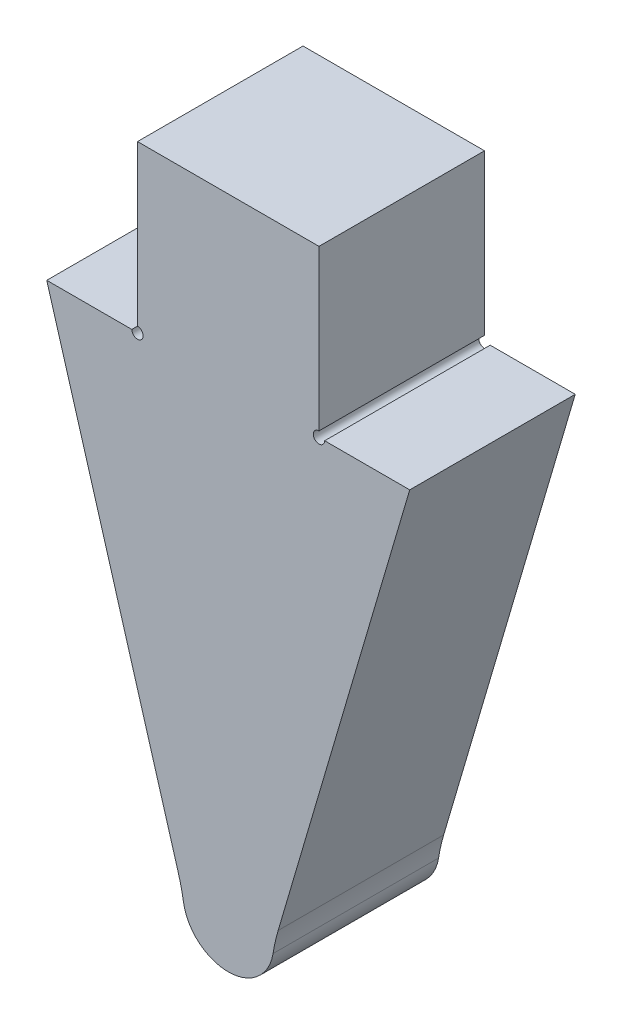
ISO-10303-21;
HEADER;
FILE_DESCRIPTION(('STEP AP214'),'2;1');
FILE_NAME('part.step','',(''),(''),'','','');
FILE_SCHEMA(('AUTOMOTIVE_DESIGN { 1 0 10303 214 1 1 1 1 }'));
ENDSEC;
DATA;
#1=APPLICATION_CONTEXT('core data for automotive mechanical design processes');
#2=APPLICATION_PROTOCOL_DEFINITION('international standard','automotive_design',2000,#1);
#3=PRODUCT_CONTEXT('',#1,'mechanical');
#4=PRODUCT('Part','Part','',(#3));
#5=PRODUCT_RELATED_PRODUCT_CATEGORY('part','',(#4));
#6=PRODUCT_DEFINITION_FORMATION('','',#4);
#7=PRODUCT_DEFINITION_CONTEXT('part definition',#1,'design');
#8=PRODUCT_DEFINITION('design','',#6,#7);
#9=PRODUCT_DEFINITION_SHAPE('','',#8);
#10=(LENGTH_UNIT() NAMED_UNIT(*) SI_UNIT(.MILLI.,.METRE.));
#11=(NAMED_UNIT(*) PLANE_ANGLE_UNIT() SI_UNIT($,.RADIAN.));
#12=(NAMED_UNIT(*) SI_UNIT($,.STERADIAN.) SOLID_ANGLE_UNIT());
#13=UNCERTAINTY_MEASURE_WITH_UNIT(LENGTH_MEASURE(1.E-05),#10,'distance_accuracy_value','');
#14=(GEOMETRIC_REPRESENTATION_CONTEXT(3) GLOBAL_UNCERTAINTY_ASSIGNED_CONTEXT((#13)) GLOBAL_UNIT_ASSIGNED_CONTEXT((#10,
#11,#12)) REPRESENTATION_CONTEXT('',''));
#15=CARTESIAN_POINT('',(0.,0.,0.));
#16=DIRECTION('',(0.,0.,1.));
#17=DIRECTION('',(1.,0.,0.));
#18=AXIS2_PLACEMENT_3D('',#15,#16,#17);
#19=CARTESIAN_POINT('',(3.175,0.,5.7912));
#20=DIRECTION('',(0.,-1.,0.));
#21=DIRECTION('',(1.,0.,0.));
#22=AXIS2_PLACEMENT_3D('',#19,#20,#21);
#23=PLANE('',#22);
#24=DIRECTION('',(-1.,0.,0.));
#25=VECTOR('',#24,1.);
#26=CARTESIAN_POINT('',(3.175,0.,0.));
#27=LINE('',#26,#25);
#28=CARTESIAN_POINT('',(3.175,0.,0.));
#29=VERTEX_POINT('',#28);
#30=CARTESIAN_POINT('',(0.1984375,0.,0.));
#31=VERTEX_POINT('',#30);
#32=EDGE_CURVE('E138',#29,#31,#27,.T.);
#33=ORIENTED_EDGE('',*,*,#32,.T.);
#34=DIRECTION('',(0.,0.,1.));
#35=VECTOR('',#34,1.);
#36=CARTESIAN_POINT('',(0.1984375,0.,0.));
#37=LINE('',#36,#35);
#38=CARTESIAN_POINT('',(0.1984375,0.,5.7912));
#39=VERTEX_POINT('',#38);
#40=EDGE_CURVE('E47',#31,#39,#37,.T.);
#41=ORIENTED_EDGE('',*,*,#40,.T.);
#42=DIRECTION('',(-1.,0.,0.));
#43=VECTOR('',#42,1.);
#44=CARTESIAN_POINT('',(3.175,0.,5.7912));
#45=LINE('',#44,#43);
#46=CARTESIAN_POINT('',(3.175,0.,5.7912));
#47=VERTEX_POINT('',#46);
#48=EDGE_CURVE('E157',#47,#39,#45,.T.);
#49=ORIENTED_EDGE('',*,*,#48,.F.);
#50=DIRECTION('',(0.,0.,-1.));
#51=VECTOR('',#50,1.);
#52=CARTESIAN_POINT('',(3.175,0.,5.7912));
#53=LINE('',#52,#51);
#54=EDGE_CURVE('E158',#47,#29,#53,.T.);
#55=ORIENTED_EDGE('',*,*,#54,.T.);
#56=EDGE_LOOP('',(#33,#41,#49,#55));
#57=FACE_BOUND('',#56,.T.);
#58=ADVANCED_FACE('F32',(#57),#23,.F.);
#59=CARTESIAN_POINT('',(0.,0.,5.7912));
#60=DIRECTION('',(-1.,0.,0.));
#61=DIRECTION('',(0.,0.,1.));
#62=AXIS2_PLACEMENT_3D('',#59,#60,#61);
#63=PLANE('',#62);
#64=DIRECTION('',(0.,1.,0.));
#65=VECTOR('',#64,1.);
#66=CARTESIAN_POINT('',(0.,0.,5.7912));
#67=LINE('',#66,#65);
#68=CARTESIAN_POINT('',(0.,0.1984375,5.7912));
#69=VERTEX_POINT('',#68);
#70=CARTESIAN_POINT('',(0.,5.7912,5.7912));
#71=VERTEX_POINT('',#70);
#72=EDGE_CURVE('E131',#69,#71,#67,.T.);
#73=ORIENTED_EDGE('',*,*,#72,.F.);
#74=DIRECTION('',(0.,0.,1.));
#75=VECTOR('',#74,1.);
#76=CARTESIAN_POINT('',(0.,0.1984375,0.));
#77=LINE('',#76,#75);
#78=CARTESIAN_POINT('',(0.,0.1984375,0.));
#79=VERTEX_POINT('',#78);
#80=EDGE_CURVE('E119',#69,#79,#77,.F.);
#81=ORIENTED_EDGE('',*,*,#80,.T.);
#82=DIRECTION('',(0.,1.,0.));
#83=VECTOR('',#82,1.);
#84=CARTESIAN_POINT('',(0.,0.,0.));
#85=LINE('',#84,#83);
#86=CARTESIAN_POINT('',(0.,5.7912,0.));
#87=VERTEX_POINT('',#86);
#88=EDGE_CURVE('E129',#79,#87,#85,.T.);
#89=ORIENTED_EDGE('',*,*,#88,.T.);
#90=DIRECTION('',(0.,0.,-1.));
#91=VECTOR('',#90,1.);
#92=CARTESIAN_POINT('',(0.,5.7912,5.7912));
#93=LINE('',#92,#91);
#94=EDGE_CURVE('E168',#71,#87,#93,.T.);
#95=ORIENTED_EDGE('',*,*,#94,.F.);
#96=EDGE_LOOP('',(#73,#81,#89,#95));
#97=FACE_BOUND('',#96,.T.);
#98=ADVANCED_FACE('F127',(#97),#63,.F.);
#99=CARTESIAN_POINT('',(0.,5.7912,5.7912));
#100=DIRECTION('',(0.,-1.,0.));
#101=DIRECTION('',(1.,0.,0.));
#102=AXIS2_PLACEMENT_3D('',#99,#100,#101);
#103=PLANE('',#102);
#104=DIRECTION('',(-1.,0.,0.));
#105=VECTOR('',#104,1.);
#106=CARTESIAN_POINT('',(0.,5.7912,0.));
#107=LINE('',#106,#105);
#108=CARTESIAN_POINT('',(-6.35,5.7912,0.));
#109=VERTEX_POINT('',#108);
#110=EDGE_CURVE('E137',#87,#109,#107,.T.);
#111=ORIENTED_EDGE('',*,*,#110,.T.);
#112=DIRECTION('',(0.,0.,-1.));
#113=VECTOR('',#112,1.);
#114=CARTESIAN_POINT('',(-6.35,5.7912,5.7912));
#115=LINE('',#114,#113);
#116=CARTESIAN_POINT('',(-6.35,5.7912,5.7912));
#117=VERTEX_POINT('',#116);
#118=EDGE_CURVE('E165',#117,#109,#115,.T.);
#119=ORIENTED_EDGE('',*,*,#118,.F.);
#120=DIRECTION('',(-1.,0.,0.));
#121=VECTOR('',#120,1.);
#122=CARTESIAN_POINT('',(0.,5.7912,5.7912));
#123=LINE('',#122,#121);
#124=EDGE_CURVE('E199',#71,#117,#123,.T.);
#125=ORIENTED_EDGE('',*,*,#124,.F.);
#126=ORIENTED_EDGE('',*,*,#94,.T.);
#127=EDGE_LOOP('',(#111,#119,#125,#126));
#128=FACE_BOUND('',#127,.T.);
#129=ADVANCED_FACE('F198',(#128),#103,.F.);
#130=CARTESIAN_POINT('',(-6.35,0.,5.7912));
#131=DIRECTION('',(1.,0.,0.));
#132=DIRECTION('',(0.,0.,-1.));
#133=AXIS2_PLACEMENT_3D('',#130,#131,#132);
#134=PLANE('',#133);
#135=DIRECTION('',(0.,-1.,0.));
#136=VECTOR('',#135,1.);
#137=CARTESIAN_POINT('',(-6.35,0.,0.));
#138=LINE('',#137,#136);
#139=CARTESIAN_POINT('',(-6.35,0.1984375,0.));
#140=VERTEX_POINT('',#139);
#141=EDGE_CURVE('E140',#109,#140,#138,.T.);
#142=ORIENTED_EDGE('',*,*,#141,.T.);
#143=DIRECTION('',(0.,0.,1.));
#144=VECTOR('',#143,1.);
#145=CARTESIAN_POINT('',(-6.35,0.1984375,0.));
#146=LINE('',#145,#144);
#147=CARTESIAN_POINT('',(-6.35,0.1984375,5.7912));
#148=VERTEX_POINT('',#147);
#149=EDGE_CURVE('E54',#140,#148,#146,.T.);
#150=ORIENTED_EDGE('',*,*,#149,.T.);
#151=DIRECTION('',(0.,-1.,0.));
#152=VECTOR('',#151,1.);
#153=CARTESIAN_POINT('',(-6.35,0.,5.7912));
#154=LINE('',#153,#152);
#155=EDGE_CURVE('E195',#117,#148,#154,.T.);
#156=ORIENTED_EDGE('',*,*,#155,.F.);
#157=ORIENTED_EDGE('',*,*,#118,.T.);
#158=EDGE_LOOP('',(#142,#150,#156,#157));
#159=FACE_BOUND('',#158,.T.);
#160=ADVANCED_FACE('F191',(#159),#134,.F.);
#161=CARTESIAN_POINT('',(-6.35,0.,5.7912));
#162=DIRECTION('',(0.,-1.,0.));
#163=DIRECTION('',(0.,0.,-1.));
#164=AXIS2_PLACEMENT_3D('',#161,#162,#163);
#165=PLANE('',#164);
#166=DIRECTION('',(-1.,0.,0.));
#167=VECTOR('',#166,1.);
#168=CARTESIAN_POINT('',(-6.35,0.,5.7912));
#169=LINE('',#168,#167);
#170=CARTESIAN_POINT('',(-6.5484375,0.,5.7912));
#171=VERTEX_POINT('',#170);
#172=CARTESIAN_POINT('',(-9.525,0.,5.7912));
#173=VERTEX_POINT('',#172);
#174=EDGE_CURVE('E202',#171,#173,#169,.T.);
#175=ORIENTED_EDGE('',*,*,#174,.F.);
#176=DIRECTION('',(0.,0.,1.));
#177=VECTOR('',#176,1.);
#178=CARTESIAN_POINT('',(-6.5484375,0.,0.));
#179=LINE('',#178,#177);
#180=CARTESIAN_POINT('',(-6.5484375,0.,0.));
#181=VERTEX_POINT('',#180);
#182=EDGE_CURVE('E226',#171,#181,#179,.F.);
#183=ORIENTED_EDGE('',*,*,#182,.T.);
#184=DIRECTION('',(-1.,0.,0.));
#185=VECTOR('',#184,1.);
#186=CARTESIAN_POINT('',(-6.35,0.,0.));
#187=LINE('',#186,#185);
#188=CARTESIAN_POINT('',(-9.525,0.,0.));
#189=VERTEX_POINT('',#188);
#190=EDGE_CURVE('E147',#181,#189,#187,.T.);
#191=ORIENTED_EDGE('',*,*,#190,.T.);
#192=DIRECTION('',(0.,0.,-1.));
#193=VECTOR('',#192,1.);
#194=CARTESIAN_POINT('',(-9.525,0.,5.7912));
#195=LINE('',#194,#193);
#196=EDGE_CURVE('E161',#173,#189,#195,.T.);
#197=ORIENTED_EDGE('',*,*,#196,.F.);
#198=EDGE_LOOP('',(#175,#183,#191,#197));
#199=FACE_BOUND('',#198,.T.);
#200=ADVANCED_FACE('F236',(#199),#165,.F.);
#201=CARTESIAN_POINT('',(-9.525,0.,5.7912));
#202=DIRECTION('',(0.95936550157127,0.28216632399155,0.));
#203=DIRECTION('',(-0.28216632399155,0.959365501571271,0.));
#204=AXIS2_PLACEMENT_3D('',#201,#202,#203);
#205=PLANE('',#204);
#206=DIRECTION('',(0.28216632399155,-0.95936550157127,0.));
#207=VECTOR('',#206,1.);
#208=CARTESIAN_POINT('',(-9.525,0.,0.));
#209=LINE('',#208,#207);
#210=CARTESIAN_POINT('',(-4.92106557201575,-15.6533770551464,0.));
#211=VERTEX_POINT('',#210);
#212=EDGE_CURVE('E149',#189,#211,#209,.T.);
#213=ORIENTED_EDGE('',*,*,#212,.T.);
#214=DIRECTION('',(0.,0.,1.));
#215=VECTOR('',#214,1.);
#216=CARTESIAN_POINT('',(-4.92106557201575,-15.6533770551464,5.7912));
#217=LINE('',#216,#215);
#218=CARTESIAN_POINT('',(-4.92106557201575,-15.6533770551464,5.7912));
#219=VERTEX_POINT('',#218);
#220=EDGE_CURVE('E175',#211,#219,#217,.T.);
#221=ORIENTED_EDGE('',*,*,#220,.T.);
#222=DIRECTION('',(0.28216632399155,-0.95936550157127,0.));
#223=VECTOR('',#222,1.);
#224=CARTESIAN_POINT('',(-9.525,0.,5.7912));
#225=LINE('',#224,#223);
#226=EDGE_CURVE('E208',#173,#219,#225,.T.);
#227=ORIENTED_EDGE('',*,*,#226,.F.);
#228=ORIENTED_EDGE('',*,*,#196,.T.);
#229=EDGE_LOOP('',(#213,#221,#227,#228));
#230=FACE_BOUND('',#229,.T.);
#231=ADVANCED_FACE('F239',(#230),#205,.F.);
#232=CARTESIAN_POINT('',(-3.175,-16.1925,5.7912));
#233=DIRECTION('',(0.,0.,-1.));
#234=DIRECTION('',(-1.,0.,0.));
#235=AXIS2_PLACEMENT_3D('',#232,#233,#234);
#236=CYLINDRICAL_SURFACE('',#235,1.5875);
#237=CARTESIAN_POINT('',(-3.175,-16.1925,5.7912));
#238=DIRECTION('',(0.,0.,1.));
#239=DIRECTION('',(1.,0.,0.));
#240=AXIS2_PLACEMENT_3D('',#237,#238,#239);
#241=CIRCLE('',#240,1.5875);
#242=CARTESIAN_POINT('',(-4.74260730139866,-16.4430266424986,5.7912));
#243=VERTEX_POINT('',#242);
#244=CARTESIAN_POINT('',(-1.60739269860133,-16.4430266424986,5.7912));
#245=VERTEX_POINT('',#244);
#246=EDGE_CURVE('E211',#243,#245,#241,.T.);
#247=ORIENTED_EDGE('',*,*,#246,.F.);
#248=DIRECTION('',(0.,0.,-1.));
#249=VECTOR('',#248,1.);
#250=CARTESIAN_POINT('',(-4.74260730139866,-16.4430266424986,5.7912));
#251=LINE('',#250,#249);
#252=CARTESIAN_POINT('',(-4.74260730139866,-16.4430266424986,0.));
#253=VERTEX_POINT('',#252);
#254=EDGE_CURVE('E172',#243,#253,#251,.T.);
#255=ORIENTED_EDGE('',*,*,#254,.T.);
#256=CARTESIAN_POINT('',(-3.175,-16.1925,0.));
#257=DIRECTION('',(0.,0.,1.));
#258=DIRECTION('',(1.,0.,0.));
#259=AXIS2_PLACEMENT_3D('',#256,#257,#258);
#260=CIRCLE('',#259,1.5875);
#261=CARTESIAN_POINT('',(-1.60739269860133,-16.4430266424986,0.));
#262=VERTEX_POINT('',#261);
#263=EDGE_CURVE('E152',#253,#262,#260,.T.);
#264=ORIENTED_EDGE('',*,*,#263,.T.);
#265=DIRECTION('',(0.,0.,-1.));
#266=VECTOR('',#265,1.);
#267=CARTESIAN_POINT('',(-1.60739269860133,-16.4430266424986,5.7912));
#268=LINE('',#267,#266);
#269=EDGE_CURVE('E170',#262,#245,#268,.F.);
#270=ORIENTED_EDGE('',*,*,#269,.T.);
#271=EDGE_LOOP('',(#247,#255,#264,#270));
#272=FACE_BOUND('',#271,.T.);
#273=ADVANCED_FACE('F248',(#272),#236,.T.);
#274=CARTESIAN_POINT('',(3.175,0.,5.7912));
#275=DIRECTION('',(-0.95936550157127,0.28216632399155,0.));
#276=DIRECTION('',(-0.28216632399155,-0.959365501571271,0.));
#277=AXIS2_PLACEMENT_3D('',#274,#275,#276);
#278=PLANE('',#277);
#279=DIRECTION('',(0.28216632399155,0.959365501571271,0.));
#280=VECTOR('',#279,1.);
#281=CARTESIAN_POINT('',(3.175,0.,5.7912));
#282=LINE('',#281,#280);
#283=CARTESIAN_POINT('',(-1.42893442798424,-15.6533770551464,5.7912));
#284=VERTEX_POINT('',#283);
#285=EDGE_CURVE('E162',#284,#47,#282,.T.);
#286=ORIENTED_EDGE('',*,*,#285,.F.);
#287=DIRECTION('',(0.,0.,1.));
#288=VECTOR('',#287,1.);
#289=CARTESIAN_POINT('',(-1.42893442798424,-15.6533770551464,0.));
#290=LINE('',#289,#288);
#291=CARTESIAN_POINT('',(-1.42893442798424,-15.6533770551464,0.));
#292=VERTEX_POINT('',#291);
#293=EDGE_CURVE('E177',#284,#292,#290,.F.);
#294=ORIENTED_EDGE('',*,*,#293,.T.);
#295=DIRECTION('',(0.28216632399155,0.959365501571271,0.));
#296=VECTOR('',#295,1.);
#297=CARTESIAN_POINT('',(3.175,0.,0.));
#298=LINE('',#297,#296);
#299=EDGE_CURVE('E155',#292,#29,#298,.T.);
#300=ORIENTED_EDGE('',*,*,#299,.T.);
#301=ORIENTED_EDGE('',*,*,#54,.F.);
#302=EDGE_LOOP('',(#286,#294,#300,#301));
#303=FACE_BOUND('',#302,.T.);
#304=ADVANCED_FACE('F221',(#303),#278,.F.);
#305=CARTESIAN_POINT('',(-3.175,-16.1925,5.7912));
#306=DIRECTION('',(0.,0.,1.));
#307=DIRECTION('',(1.,0.,0.));
#308=AXIS2_PLACEMENT_3D('',#305,#306,#307);
#309=PLANE('',#308);
#310=CARTESIAN_POINT('',(0.,0.,5.7912));
#311=DIRECTION('',(0.,0.,1.));
#312=DIRECTION('',(1.,0.,0.));
#313=AXIS2_PLACEMENT_3D('',#310,#311,#312);
#314=CIRCLE('',#313,0.1984375);
#315=EDGE_CURVE('E132',#69,#39,#314,.T.);
#316=ORIENTED_EDGE('',*,*,#315,.F.);
#317=ORIENTED_EDGE('',*,*,#72,.T.);
#318=ORIENTED_EDGE('',*,*,#124,.T.);
#319=ORIENTED_EDGE('',*,*,#155,.T.);
#320=CARTESIAN_POINT('',(-6.35,0.,5.7912));
#321=DIRECTION('',(0.,0.,1.));
#322=DIRECTION('',(1.,0.,0.));
#323=AXIS2_PLACEMENT_3D('',#320,#321,#322);
#324=CIRCLE('',#323,0.1984375);
#325=EDGE_CURVE('E228',#171,#148,#324,.T.);
#326=ORIENTED_EDGE('',*,*,#325,.F.);
#327=ORIENTED_EDGE('',*,*,#174,.T.);
#328=ORIENTED_EDGE('',*,*,#226,.T.);
#329=CARTESIAN_POINT('',(-11.0130365069933,-17.4451332124928,5.7912));
#330=DIRECTION('',(0.,0.,1.));
#331=DIRECTION('',(1.,0.,0.));
#332=AXIS2_PLACEMENT_3D('',#329,#330,#331);
#333=CIRCLE('',#332,6.35);
#334=EDGE_CURVE('E182',#219,#243,#333,.F.);
#335=ORIENTED_EDGE('',*,*,#334,.T.);
#336=ORIENTED_EDGE('',*,*,#246,.T.);
#337=CARTESIAN_POINT('',(4.66303650699332,-17.4451332124928,5.7912));
#338=DIRECTION('',(0.,0.,1.));
#339=DIRECTION('',(1.,0.,0.));
#340=AXIS2_PLACEMENT_3D('',#337,#338,#339);
#341=CIRCLE('',#340,6.35);
#342=EDGE_CURVE('E186',#245,#284,#341,.F.);
#343=ORIENTED_EDGE('',*,*,#342,.T.);
#344=ORIENTED_EDGE('',*,*,#285,.T.);
#345=ORIENTED_EDGE('',*,*,#48,.T.);
#346=EDGE_LOOP('',(#316,#317,#318,#319,#326,#327,#328,#335,#336,#343,#344,#345));
#347=FACE_BOUND('',#346,.T.);
#348=ADVANCED_FACE('F216',(#347),#309,.T.);
#349=CARTESIAN_POINT('',(-3.175,-16.1925,0.));
#350=DIRECTION('',(0.,0.,1.));
#351=DIRECTION('',(1.,0.,0.));
#352=AXIS2_PLACEMENT_3D('',#349,#350,#351);
#353=PLANE('',#352);
#354=ORIENTED_EDGE('',*,*,#88,.F.);
#355=CARTESIAN_POINT('',(0.,0.,0.));
#356=DIRECTION('',(0.,0.,1.));
#357=DIRECTION('',(1.,0.,0.));
#358=AXIS2_PLACEMENT_3D('',#355,#356,#357);
#359=CIRCLE('',#358,0.1984375);
#360=EDGE_CURVE('E11',#79,#31,#359,.T.);
#361=ORIENTED_EDGE('',*,*,#360,.T.);
#362=ORIENTED_EDGE('',*,*,#32,.F.);
#363=ORIENTED_EDGE('',*,*,#299,.F.);
#364=CARTESIAN_POINT('',(4.66303650699332,-17.4451332124928,0.));
#365=DIRECTION('',(0.,0.,1.));
#366=DIRECTION('',(1.,0.,0.));
#367=AXIS2_PLACEMENT_3D('',#364,#365,#366);
#368=CIRCLE('',#367,6.35);
#369=EDGE_CURVE('E184',#292,#262,#368,.T.);
#370=ORIENTED_EDGE('',*,*,#369,.T.);
#371=ORIENTED_EDGE('',*,*,#263,.F.);
#372=CARTESIAN_POINT('',(-11.0130365069933,-17.4451332124928,0.));
#373=DIRECTION('',(0.,0.,1.));
#374=DIRECTION('',(1.,0.,0.));
#375=AXIS2_PLACEMENT_3D('',#372,#373,#374);
#376=CIRCLE('',#375,6.35);
#377=EDGE_CURVE('E180',#253,#211,#376,.T.);
#378=ORIENTED_EDGE('',*,*,#377,.T.);
#379=ORIENTED_EDGE('',*,*,#212,.F.);
#380=ORIENTED_EDGE('',*,*,#190,.F.);
#381=CARTESIAN_POINT('',(-6.35,0.,0.));
#382=DIRECTION('',(0.,0.,1.));
#383=DIRECTION('',(1.,0.,0.));
#384=AXIS2_PLACEMENT_3D('',#381,#382,#383);
#385=CIRCLE('',#384,0.1984375);
#386=EDGE_CURVE('E40',#181,#140,#385,.T.);
#387=ORIENTED_EDGE('',*,*,#386,.T.);
#388=ORIENTED_EDGE('',*,*,#141,.F.);
#389=ORIENTED_EDGE('',*,*,#110,.F.);
#390=EDGE_LOOP('',(#354,#361,#362,#363,#370,#371,#378,#379,#380,#387,#388,#389));
#391=FACE_BOUND('',#390,.T.);
#392=ADVANCED_FACE('F135',(#391),#353,.F.);
#393=CARTESIAN_POINT('',(-11.0130365069933,-17.4451332124928,5.7912));
#394=DIRECTION('',(0.,0.,-1.));
#395=DIRECTION('',(-1.,0.,0.));
#396=AXIS2_PLACEMENT_3D('',#393,#394,#395);
#397=CYLINDRICAL_SURFACE('',#396,6.35);
#398=ORIENTED_EDGE('',*,*,#334,.F.);
#399=ORIENTED_EDGE('',*,*,#220,.F.);
#400=ORIENTED_EDGE('',*,*,#377,.F.);
#401=ORIENTED_EDGE('',*,*,#254,.F.);
#402=EDGE_LOOP('',(#398,#399,#400,#401));
#403=FACE_BOUND('',#402,.T.);
#404=ADVANCED_FACE('F245',(#403),#397,.F.);
#405=CARTESIAN_POINT('',(4.66303650699332,-17.4451332124928,5.7912));
#406=DIRECTION('',(0.,0.,-1.));
#407=DIRECTION('',(-1.,0.,0.));
#408=AXIS2_PLACEMENT_3D('',#405,#406,#407);
#409=CYLINDRICAL_SURFACE('',#408,6.35);
#410=ORIENTED_EDGE('',*,*,#342,.F.);
#411=ORIENTED_EDGE('',*,*,#269,.F.);
#412=ORIENTED_EDGE('',*,*,#369,.F.);
#413=ORIENTED_EDGE('',*,*,#293,.F.);
#414=EDGE_LOOP('',(#410,#411,#412,#413));
#415=FACE_BOUND('',#414,.T.);
#416=ADVANCED_FACE('F34',(#415),#409,.F.);
#417=CARTESIAN_POINT('',(-6.35,0.,0.));
#418=DIRECTION('',(0.,0.,1.));
#419=DIRECTION('',(1.,0.,0.));
#420=AXIS2_PLACEMENT_3D('',#417,#418,#419);
#421=CYLINDRICAL_SURFACE('',#420,0.1984375);
#422=ORIENTED_EDGE('',*,*,#386,.F.);
#423=ORIENTED_EDGE('',*,*,#182,.F.);
#424=ORIENTED_EDGE('',*,*,#325,.T.);
#425=ORIENTED_EDGE('',*,*,#149,.F.);
#426=EDGE_LOOP('',(#422,#423,#424,#425));
#427=FACE_BOUND('',#426,.T.);
#428=ADVANCED_FACE('F232',(#427),#421,.F.);
#429=CARTESIAN_POINT('',(0.,0.,0.));
#430=DIRECTION('',(0.,0.,1.));
#431=DIRECTION('',(1.,0.,0.));
#432=AXIS2_PLACEMENT_3D('',#429,#430,#431);
#433=CYLINDRICAL_SURFACE('',#432,0.1984375);
#434=ORIENTED_EDGE('',*,*,#360,.F.);
#435=ORIENTED_EDGE('',*,*,#80,.F.);
#436=ORIENTED_EDGE('',*,*,#315,.T.);
#437=ORIENTED_EDGE('',*,*,#40,.F.);
#438=EDGE_LOOP('',(#434,#435,#436,#437));
#439=FACE_BOUND('',#438,.T.);
#440=ADVANCED_FACE('F118',(#439),#433,.F.);
#441=CLOSED_SHELL('',(#58,#98,#129,#160,#200,#231,#273,#304,#348,#392,#404,#416,#428,#440));
#442=MANIFOLD_SOLID_BREP('B2',#441);
#443=ADVANCED_BREP_SHAPE_REPRESENTATION('',(#18,#442),#14);
#444=SHAPE_DEFINITION_REPRESENTATION(#9,#443);
ENDSEC;
END-ISO-10303-21;
